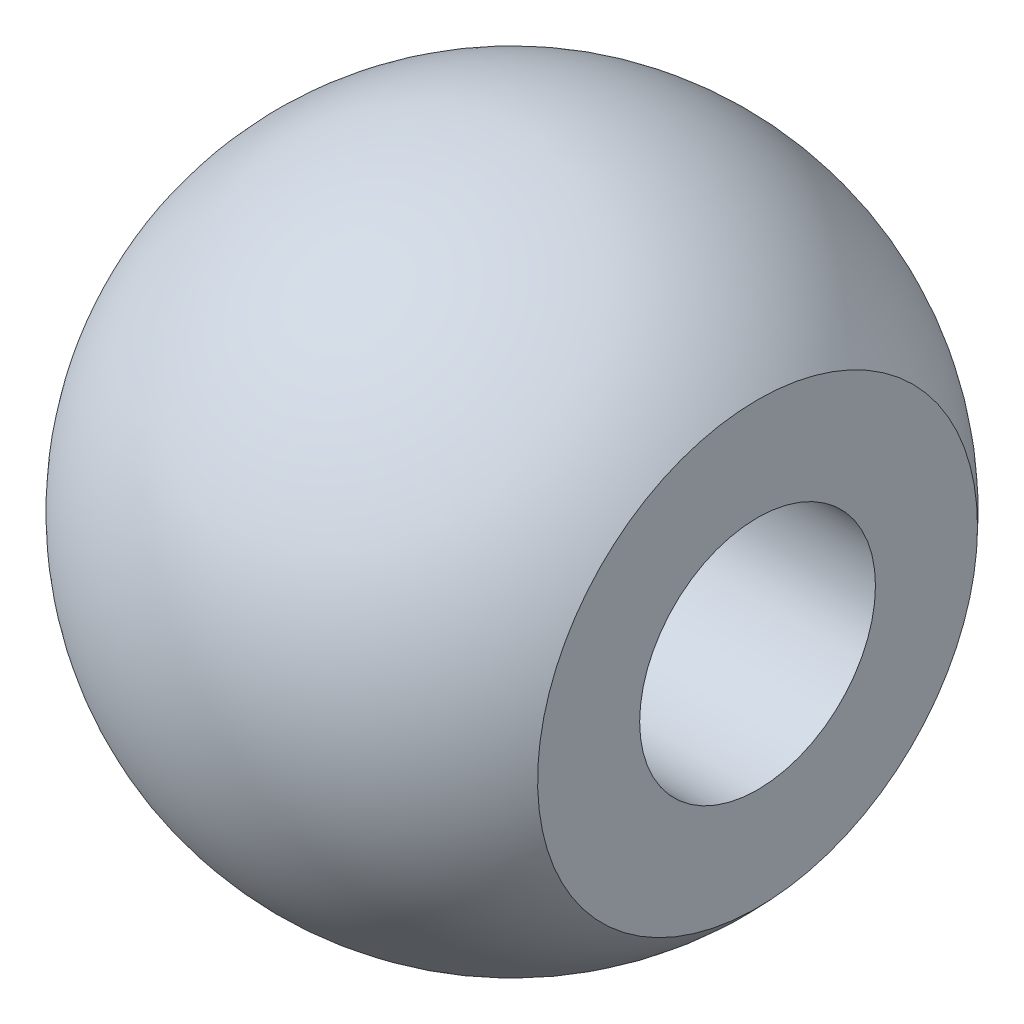
ISO-10303-21;
HEADER;
FILE_DESCRIPTION(('STEP AP214'),'2;1');
FILE_NAME('part.step','',(''),(''),'','','');
FILE_SCHEMA(('AUTOMOTIVE_DESIGN { 1 0 10303 214 1 1 1 1 }'));
ENDSEC;
DATA;
#1=APPLICATION_CONTEXT('core data for automotive mechanical design processes');
#2=APPLICATION_PROTOCOL_DEFINITION('international standard','automotive_design',2000,#1);
#3=PRODUCT_CONTEXT('',#1,'mechanical');
#4=PRODUCT('Part','Part','',(#3));
#5=PRODUCT_RELATED_PRODUCT_CATEGORY('part','',(#4));
#6=PRODUCT_DEFINITION_FORMATION('','',#4);
#7=PRODUCT_DEFINITION_CONTEXT('part definition',#1,'design');
#8=PRODUCT_DEFINITION('design','',#6,#7);
#9=PRODUCT_DEFINITION_SHAPE('','',#8);
#10=(LENGTH_UNIT() NAMED_UNIT(*) SI_UNIT(.MILLI.,.METRE.));
#11=(NAMED_UNIT(*) PLANE_ANGLE_UNIT() SI_UNIT($,.RADIAN.));
#12=(NAMED_UNIT(*) SI_UNIT($,.STERADIAN.) SOLID_ANGLE_UNIT());
#13=UNCERTAINTY_MEASURE_WITH_UNIT(LENGTH_MEASURE(1.E-05),#10,'distance_accuracy_value','');
#14=(GEOMETRIC_REPRESENTATION_CONTEXT(3) GLOBAL_UNCERTAINTY_ASSIGNED_CONTEXT((#13)) GLOBAL_UNIT_ASSIGNED_CONTEXT((#10,
#11,#12)) REPRESENTATION_CONTEXT('',''));
#15=CARTESIAN_POINT('',(0.,0.,0.));
#16=DIRECTION('',(0.,0.,1.));
#17=DIRECTION('',(1.,0.,0.));
#18=AXIS2_PLACEMENT_3D('',#15,#16,#17);
#19=CARTESIAN_POINT('',(0.,0.,0.));
#20=DIRECTION('',(1.,0.,0.));
#21=DIRECTION('',(0.,1.,0.));
#22=AXIS2_PLACEMENT_3D('',#19,#20,#21);
#23=SPHERICAL_SURFACE('',#22,7.1374);
#24=CARTESIAN_POINT('',(5.31611441844511,0.,0.));
#25=DIRECTION('',(1.,0.,0.));
#26=DIRECTION('',(0.,0.,-1.));
#27=AXIS2_PLACEMENT_3D('',#24,#25,#26);
#28=CIRCLE('',#27,4.7625);
#29=CARTESIAN_POINT('',(5.31611441844511,0.,-4.7625));
#30=VERTEX_POINT('',#29);
#31=EDGE_CURVE('E13',#30,#30,#28,.T.);
#32=ORIENTED_EDGE('',*,*,#31,.F.);
#33=EDGE_LOOP('',(#32));
#34=FACE_BOUND('',#33,.T.);
#35=ADVANCED_FACE('F50',(#34),#23,.T.);
#36=CARTESIAN_POINT('',(5.31611441844511,0.,0.));
#37=DIRECTION('',(1.,0.,0.));
#38=DIRECTION('',(0.,0.,-1.));
#39=AXIS2_PLACEMENT_3D('',#36,#37,#38);
#40=PLANE('',#39);
#41=CARTESIAN_POINT('',(5.31611441844511,0.,0.));
#42=DIRECTION('',(1.,0.,0.));
#43=DIRECTION('',(0.,0.,-1.));
#44=AXIS2_PLACEMENT_3D('',#41,#42,#43);
#45=CIRCLE('',#44,2.5527);
#46=CARTESIAN_POINT('',(5.31611441844511,0.,-2.5527));
#47=VERTEX_POINT('',#46);
#48=EDGE_CURVE('E68',#47,#47,#45,.T.);
#49=ORIENTED_EDGE('',*,*,#48,.F.);
#50=EDGE_LOOP('',(#49));
#51=FACE_BOUND('',#50,.T.);
#52=ORIENTED_EDGE('',*,*,#31,.T.);
#53=EDGE_LOOP('',(#52));
#54=FACE_BOUND('',#53,.T.);
#55=ADVANCED_FACE('F63',(#51,#54),#40,.T.);
#56=CARTESIAN_POINT('',(-3.57388558155489,0.,0.));
#57=DIRECTION('',(1.,0.,0.));
#58=DIRECTION('',(0.,0.,-1.));
#59=AXIS2_PLACEMENT_3D('',#56,#57,#58);
#60=CONICAL_SURFACE('',#59,2.5527,1.02974425867665);
#61=CARTESIAN_POINT('',(-5.10770248374654,0.,0.));
#62=VERTEX_POINT('',#61);
#63=VERTEX_LOOP('',#62);
#64=FACE_BOUND('',#63,.T.);
#65=CARTESIAN_POINT('',(-3.57388558155489,0.,0.));
#66=DIRECTION('',(1.,0.,0.));
#67=DIRECTION('',(0.,0.,-1.));
#68=AXIS2_PLACEMENT_3D('',#65,#66,#67);
#69=CIRCLE('',#68,2.5527);
#70=CARTESIAN_POINT('',(-3.57388558155489,0.,-2.5527));
#71=VERTEX_POINT('',#70);
#72=EDGE_CURVE('E56',#71,#71,#69,.T.);
#73=ORIENTED_EDGE('',*,*,#72,.T.);
#74=EDGE_LOOP('',(#73));
#75=FACE_BOUND('',#74,.T.);
#76=ADVANCED_FACE('F59',(#64,#75),#60,.F.);
#77=CARTESIAN_POINT('',(5.31611441844511,0.,0.));
#78=DIRECTION('',(1.,0.,0.));
#79=DIRECTION('',(0.,0.,-1.));
#80=AXIS2_PLACEMENT_3D('',#77,#78,#79);
#81=CYLINDRICAL_SURFACE('',#80,2.5527);
#82=ORIENTED_EDGE('',*,*,#72,.F.);
#83=EDGE_LOOP('',(#82));
#84=FACE_BOUND('',#83,.T.);
#85=ORIENTED_EDGE('',*,*,#48,.T.);
#86=EDGE_LOOP('',(#85));
#87=FACE_BOUND('',#86,.T.);
#88=ADVANCED_FACE('F62',(#84,#87),#81,.F.);
#89=CLOSED_SHELL('',(#35,#55,#76,#88));
#90=MANIFOLD_SOLID_BREP('B2',#89);
#91=ADVANCED_BREP_SHAPE_REPRESENTATION('',(#18,#90),#14);
#92=SHAPE_DEFINITION_REPRESENTATION(#9,#91);
ENDSEC;
END-ISO-10303-21;
